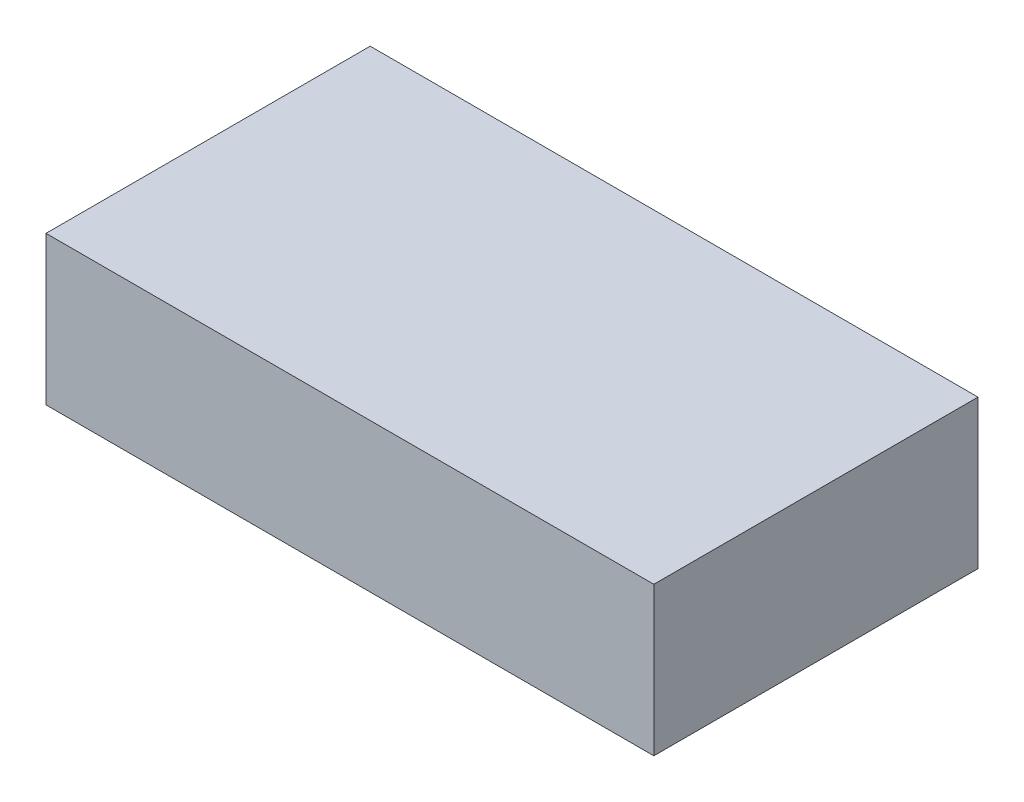
ISO-10303-21;
HEADER;
FILE_DESCRIPTION(('STEP AP214'),'2;1');
FILE_NAME('part.step','',(''),(''),'','','');
FILE_SCHEMA(('AUTOMOTIVE_DESIGN { 1 0 10303 214 1 1 1 1 }'));
ENDSEC;
DATA;
#1=APPLICATION_CONTEXT('core data for automotive mechanical design processes');
#2=APPLICATION_PROTOCOL_DEFINITION('international standard','automotive_design',2000,#1);
#3=PRODUCT_CONTEXT('',#1,'mechanical');
#4=PRODUCT('Part','Part','',(#3));
#5=PRODUCT_RELATED_PRODUCT_CATEGORY('part','',(#4));
#6=PRODUCT_DEFINITION_FORMATION('','',#4);
#7=PRODUCT_DEFINITION_CONTEXT('part definition',#1,'design');
#8=PRODUCT_DEFINITION('design','',#6,#7);
#9=PRODUCT_DEFINITION_SHAPE('','',#8);
#10=(LENGTH_UNIT() NAMED_UNIT(*) SI_UNIT(.MILLI.,.METRE.));
#11=(NAMED_UNIT(*) PLANE_ANGLE_UNIT() SI_UNIT($,.RADIAN.));
#12=(NAMED_UNIT(*) SI_UNIT($,.STERADIAN.) SOLID_ANGLE_UNIT());
#13=UNCERTAINTY_MEASURE_WITH_UNIT(LENGTH_MEASURE(1.E-05),#10,'distance_accuracy_value','');
#14=(GEOMETRIC_REPRESENTATION_CONTEXT(3) GLOBAL_UNCERTAINTY_ASSIGNED_CONTEXT((#13)) GLOBAL_UNIT_ASSIGNED_CONTEXT((#10,
#11,#12)) REPRESENTATION_CONTEXT('',''));
#15=CARTESIAN_POINT('',(0.,0.,0.));
#16=DIRECTION('',(0.,0.,1.));
#17=DIRECTION('',(1.,0.,0.));
#18=AXIS2_PLACEMENT_3D('',#15,#16,#17);
#19=CARTESIAN_POINT('',(22.5,11.,12.));
#20=DIRECTION('',(-1.,0.,0.));
#21=DIRECTION('',(0.,0.,1.));
#22=AXIS2_PLACEMENT_3D('',#19,#20,#21);
#23=PLANE('',#22);
#24=DIRECTION('',(0.,0.,-1.));
#25=VECTOR('',#24,1.);
#26=CARTESIAN_POINT('',(22.5,0.,12.));
#27=LINE('',#26,#25);
#28=CARTESIAN_POINT('',(22.5,0.,12.));
#29=VERTEX_POINT('',#28);
#30=CARTESIAN_POINT('',(22.5,0.,-12.));
#31=VERTEX_POINT('',#30);
#32=EDGE_CURVE('E100',#29,#31,#27,.T.);
#33=ORIENTED_EDGE('',*,*,#32,.T.);
#34=DIRECTION('',(0.,-1.,0.));
#35=VECTOR('',#34,1.);
#36=CARTESIAN_POINT('',(22.5,11.,-12.));
#37=LINE('',#36,#35);
#38=CARTESIAN_POINT('',(22.5,11.,-12.));
#39=VERTEX_POINT('',#38);
#40=EDGE_CURVE('E11',#39,#31,#37,.T.);
#41=ORIENTED_EDGE('',*,*,#40,.F.);
#42=DIRECTION('',(0.,0.,-1.));
#43=VECTOR('',#42,1.);
#44=CARTESIAN_POINT('',(22.5,11.,12.));
#45=LINE('',#44,#43);
#46=CARTESIAN_POINT('',(22.5,11.,12.));
#47=VERTEX_POINT('',#46);
#48=EDGE_CURVE('E88',#47,#39,#45,.T.);
#49=ORIENTED_EDGE('',*,*,#48,.F.);
#50=DIRECTION('',(0.,-1.,0.));
#51=VECTOR('',#50,1.);
#52=CARTESIAN_POINT('',(22.5,11.,12.));
#53=LINE('',#52,#51);
#54=EDGE_CURVE('E96',#47,#29,#53,.T.);
#55=ORIENTED_EDGE('',*,*,#54,.T.);
#56=EDGE_LOOP('',(#33,#41,#49,#55));
#57=FACE_BOUND('',#56,.T.);
#58=ADVANCED_FACE('F37',(#57),#23,.F.);
#59=CARTESIAN_POINT('',(-22.5,11.,-12.));
#60=DIRECTION('',(0.,0.,1.));
#61=DIRECTION('',(1.,0.,0.));
#62=AXIS2_PLACEMENT_3D('',#59,#60,#61);
#63=PLANE('',#62);
#64=DIRECTION('',(-1.,0.,0.));
#65=VECTOR('',#64,1.);
#66=CARTESIAN_POINT('',(-22.5,0.,-12.));
#67=LINE('',#66,#65);
#68=CARTESIAN_POINT('',(-22.5,0.,-12.));
#69=VERTEX_POINT('',#68);
#70=EDGE_CURVE('E92',#31,#69,#67,.T.);
#71=ORIENTED_EDGE('',*,*,#70,.T.);
#72=DIRECTION('',(0.,-1.,0.));
#73=VECTOR('',#72,1.);
#74=CARTESIAN_POINT('',(-22.5,11.,-12.));
#75=LINE('',#74,#73);
#76=CARTESIAN_POINT('',(-22.5,11.,-12.));
#77=VERTEX_POINT('',#76);
#78=EDGE_CURVE('E45',#77,#69,#75,.T.);
#79=ORIENTED_EDGE('',*,*,#78,.F.);
#80=DIRECTION('',(-1.,0.,0.));
#81=VECTOR('',#80,1.);
#82=CARTESIAN_POINT('',(-22.5,11.,-12.));
#83=LINE('',#82,#81);
#84=EDGE_CURVE('E83',#39,#77,#83,.T.);
#85=ORIENTED_EDGE('',*,*,#84,.F.);
#86=ORIENTED_EDGE('',*,*,#40,.T.);
#87=EDGE_LOOP('',(#71,#79,#85,#86));
#88=FACE_BOUND('',#87,.T.);
#89=ADVANCED_FACE('F91',(#88),#63,.F.);
#90=CARTESIAN_POINT('',(-22.5,11.,12.));
#91=DIRECTION('',(1.,0.,0.));
#92=DIRECTION('',(0.,0.,-1.));
#93=AXIS2_PLACEMENT_3D('',#90,#91,#92);
#94=PLANE('',#93);
#95=DIRECTION('',(0.,0.,1.));
#96=VECTOR('',#95,1.);
#97=CARTESIAN_POINT('',(-22.5,0.,12.));
#98=LINE('',#97,#96);
#99=CARTESIAN_POINT('',(-22.5,0.,12.));
#100=VERTEX_POINT('',#99);
#101=EDGE_CURVE('E70',#69,#100,#98,.T.);
#102=ORIENTED_EDGE('',*,*,#101,.T.);
#103=DIRECTION('',(0.,-1.,0.));
#104=VECTOR('',#103,1.);
#105=CARTESIAN_POINT('',(-22.5,11.,12.));
#106=LINE('',#105,#104);
#107=CARTESIAN_POINT('',(-22.5,11.,12.));
#108=VERTEX_POINT('',#107);
#109=EDGE_CURVE('E93',#108,#100,#106,.T.);
#110=ORIENTED_EDGE('',*,*,#109,.F.);
#111=DIRECTION('',(0.,0.,1.));
#112=VECTOR('',#111,1.);
#113=CARTESIAN_POINT('',(-22.5,11.,12.));
#114=LINE('',#113,#112);
#115=EDGE_CURVE('E86',#77,#108,#114,.T.);
#116=ORIENTED_EDGE('',*,*,#115,.F.);
#117=ORIENTED_EDGE('',*,*,#78,.T.);
#118=EDGE_LOOP('',(#102,#110,#116,#117));
#119=FACE_BOUND('',#118,.T.);
#120=ADVANCED_FACE('F94',(#119),#94,.F.);
#121=CARTESIAN_POINT('',(-22.5,11.,12.));
#122=DIRECTION('',(0.,0.,-1.));
#123=DIRECTION('',(-1.,0.,0.));
#124=AXIS2_PLACEMENT_3D('',#121,#122,#123);
#125=PLANE('',#124);
#126=DIRECTION('',(1.,0.,0.));
#127=VECTOR('',#126,1.);
#128=CARTESIAN_POINT('',(-22.5,0.,12.));
#129=LINE('',#128,#127);
#130=EDGE_CURVE('E76',#100,#29,#129,.T.);
#131=ORIENTED_EDGE('',*,*,#130,.T.);
#132=ORIENTED_EDGE('',*,*,#54,.F.);
#133=DIRECTION('',(1.,0.,0.));
#134=VECTOR('',#133,1.);
#135=CARTESIAN_POINT('',(-22.5,11.,12.));
#136=LINE('',#135,#134);
#137=EDGE_CURVE('E53',#108,#47,#136,.T.);
#138=ORIENTED_EDGE('',*,*,#137,.F.);
#139=ORIENTED_EDGE('',*,*,#109,.T.);
#140=EDGE_LOOP('',(#131,#132,#138,#139));
#141=FACE_BOUND('',#140,.T.);
#142=ADVANCED_FACE('F107',(#141),#125,.F.);
#143=CARTESIAN_POINT('',(0.,11.,0.));
#144=DIRECTION('',(0.,-1.,0.));
#145=DIRECTION('',(0.,0.,-1.));
#146=AXIS2_PLACEMENT_3D('',#143,#144,#145);
#147=PLANE('',#146);
#148=ORIENTED_EDGE('',*,*,#48,.T.);
#149=ORIENTED_EDGE('',*,*,#84,.T.);
#150=ORIENTED_EDGE('',*,*,#115,.T.);
#151=ORIENTED_EDGE('',*,*,#137,.T.);
#152=EDGE_LOOP('',(#148,#149,#150,#151));
#153=FACE_BOUND('',#152,.T.);
#154=ADVANCED_FACE('F84',(#153),#147,.F.);
#155=CARTESIAN_POINT('',(0.,0.,0.));
#156=DIRECTION('',(0.,-1.,0.));
#157=DIRECTION('',(0.,0.,-1.));
#158=AXIS2_PLACEMENT_3D('',#155,#156,#157);
#159=PLANE('',#158);
#160=ORIENTED_EDGE('',*,*,#32,.F.);
#161=ORIENTED_EDGE('',*,*,#130,.F.);
#162=ORIENTED_EDGE('',*,*,#101,.F.);
#163=ORIENTED_EDGE('',*,*,#70,.F.);
#164=EDGE_LOOP('',(#160,#161,#162,#163));
#165=FACE_BOUND('',#164,.T.);
#166=ADVANCED_FACE('F110',(#165),#159,.T.);
#167=CLOSED_SHELL('',(#58,#89,#120,#142,#154,#166));
#168=MANIFOLD_SOLID_BREP('B2',#167);
#169=ADVANCED_BREP_SHAPE_REPRESENTATION('',(#18,#168),#14);
#170=SHAPE_DEFINITION_REPRESENTATION(#9,#169);
ENDSEC;
END-ISO-10303-21;
